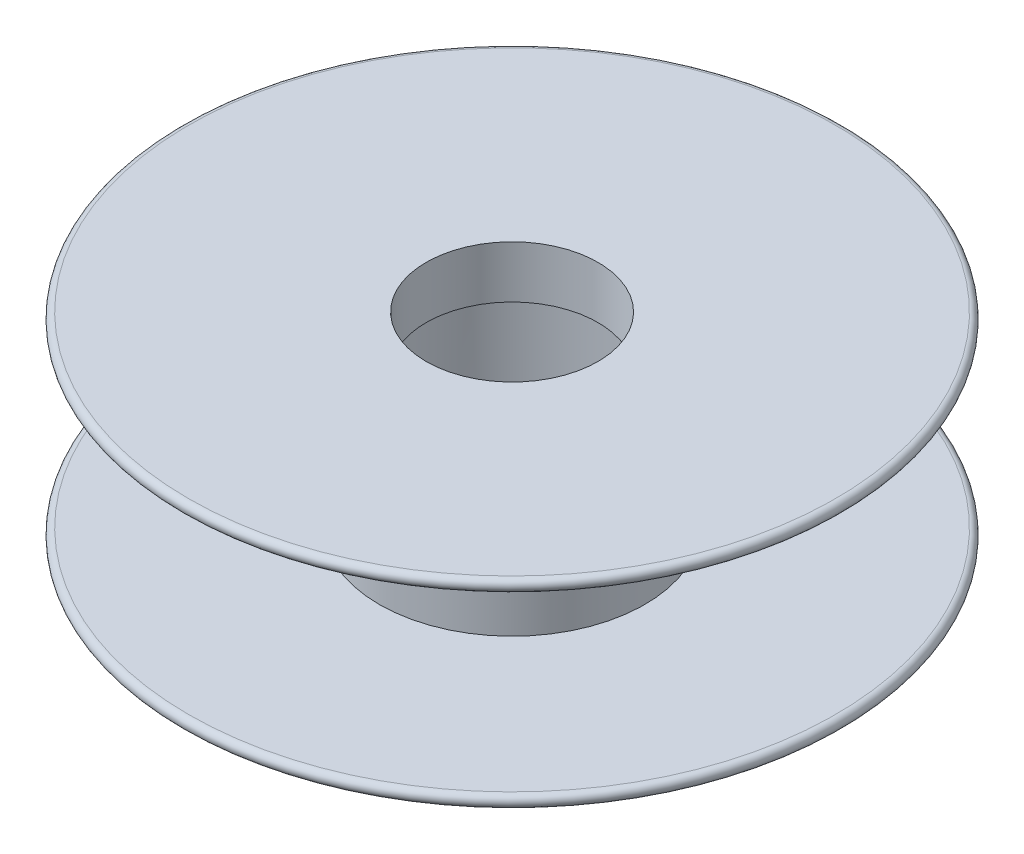
ISO-10303-21;
HEADER;
FILE_DESCRIPTION(('STEP AP214'),'2;1');
FILE_NAME('part.step','',(''),(''),'','','');
FILE_SCHEMA(('AUTOMOTIVE_DESIGN { 1 0 10303 214 1 1 1 1 }'));
ENDSEC;
DATA;
#1=APPLICATION_CONTEXT('core data for automotive mechanical design processes');
#2=APPLICATION_PROTOCOL_DEFINITION('international standard','automotive_design',2000,#1);
#3=PRODUCT_CONTEXT('',#1,'mechanical');
#4=PRODUCT('Part','Part','',(#3));
#5=PRODUCT_RELATED_PRODUCT_CATEGORY('part','',(#4));
#6=PRODUCT_DEFINITION_FORMATION('','',#4);
#7=PRODUCT_DEFINITION_CONTEXT('part definition',#1,'design');
#8=PRODUCT_DEFINITION('design','',#6,#7);
#9=PRODUCT_DEFINITION_SHAPE('','',#8);
#10=(LENGTH_UNIT() NAMED_UNIT(*) SI_UNIT(.MILLI.,.METRE.));
#11=(NAMED_UNIT(*) PLANE_ANGLE_UNIT() SI_UNIT($,.RADIAN.));
#12=(NAMED_UNIT(*) SI_UNIT($,.STERADIAN.) SOLID_ANGLE_UNIT());
#13=UNCERTAINTY_MEASURE_WITH_UNIT(LENGTH_MEASURE(1.E-05),#10,'distance_accuracy_value','');
#14=(GEOMETRIC_REPRESENTATION_CONTEXT(3) GLOBAL_UNCERTAINTY_ASSIGNED_CONTEXT((#13)) GLOBAL_UNIT_ASSIGNED_CONTEXT((#10,
#11,#12)) REPRESENTATION_CONTEXT('',''));
#15=CARTESIAN_POINT('',(0.,0.,0.));
#16=DIRECTION('',(0.,0.,1.));
#17=DIRECTION('',(1.,0.,0.));
#18=AXIS2_PLACEMENT_3D('',#15,#16,#17);
#19=CARTESIAN_POINT('',(0.,3.7,0.));
#20=DIRECTION('',(0.,1.,0.));
#21=DIRECTION('',(0.,0.,1.));
#22=AXIS2_PLACEMENT_3D('',#19,#20,#21);
#23=PLANE('',#22);
#24=CARTESIAN_POINT('',(0.,3.7,0.));
#25=DIRECTION('',(0.,1.,0.));
#26=DIRECTION('',(0.,0.,1.));
#27=AXIS2_PLACEMENT_3D('',#24,#25,#26);
#28=CIRCLE('',#27,97.4);
#29=CARTESIAN_POINT('',(0.,3.7,97.4));
#30=VERTEX_POINT('',#29);
#31=EDGE_CURVE('E52',#30,#30,#28,.T.);
#32=ORIENTED_EDGE('',*,*,#31,.T.);
#33=EDGE_LOOP('',(#32));
#34=FACE_BOUND('',#33,.T.);
#35=CARTESIAN_POINT('',(0.,3.7,0.));
#36=DIRECTION('',(0.,1.,0.));
#37=DIRECTION('',(0.,0.,1.));
#38=AXIS2_PLACEMENT_3D('',#35,#36,#37);
#39=CIRCLE('',#38,40.);
#40=CARTESIAN_POINT('',(0.,3.7,40.));
#41=VERTEX_POINT('',#40);
#42=EDGE_CURVE('E61',#41,#41,#39,.T.);
#43=ORIENTED_EDGE('',*,*,#42,.F.);
#44=EDGE_LOOP('',(#43));
#45=FACE_BOUND('',#44,.T.);
#46=ADVANCED_FACE('F37',(#34,#45),#23,.T.);
#47=CARTESIAN_POINT('',(0.,1.85,0.));
#48=DIRECTION('',(0.,1.,0.));
#49=DIRECTION('',(0.,0.,1.));
#50=AXIS2_PLACEMENT_3D('',#47,#48,#49);
#51=TOROIDAL_SURFACE('',#50,97.4,1.85);
#52=ORIENTED_EDGE('',*,*,#31,.F.);
#53=EDGE_LOOP('',(#52));
#54=FACE_BOUND('',#53,.T.);
#55=CARTESIAN_POINT('',(0.,0.,0.));
#56=DIRECTION('',(0.,1.,0.));
#57=DIRECTION('',(0.,0.,1.));
#58=AXIS2_PLACEMENT_3D('',#55,#56,#57);
#59=CIRCLE('',#58,97.4);
#60=CARTESIAN_POINT('',(0.,0.,97.4));
#61=VERTEX_POINT('',#60);
#62=EDGE_CURVE('E45',#61,#61,#59,.F.);
#63=ORIENTED_EDGE('',*,*,#62,.F.);
#64=EDGE_LOOP('',(#63));
#65=FACE_BOUND('',#64,.T.);
#66=ADVANCED_FACE('F39',(#54,#65),#51,.T.);
#67=CARTESIAN_POINT('',(0.,0.,0.));
#68=DIRECTION('',(0.,1.,0.));
#69=DIRECTION('',(0.,0.,1.));
#70=AXIS2_PLACEMENT_3D('',#67,#68,#69);
#71=PLANE('',#70);
#72=ORIENTED_EDGE('',*,*,#62,.T.);
#73=EDGE_LOOP('',(#72));
#74=FACE_BOUND('',#73,.T.);
#75=CARTESIAN_POINT('',(0.,0.,0.));
#76=DIRECTION('',(0.,1.,0.));
#77=DIRECTION('',(0.,0.,1.));
#78=AXIS2_PLACEMENT_3D('',#75,#76,#77);
#79=CIRCLE('',#78,25.875);
#80=CARTESIAN_POINT('',(0.,0.,25.875));
#81=VERTEX_POINT('',#80);
#82=EDGE_CURVE('E56',#81,#81,#79,.T.);
#83=ORIENTED_EDGE('',*,*,#82,.T.);
#84=EDGE_LOOP('',(#83));
#85=FACE_BOUND('',#84,.T.);
#86=ADVANCED_FACE('F113',(#74,#85),#71,.F.);
#87=CARTESIAN_POINT('',(0.,3.7,0.));
#88=DIRECTION('',(0.,-1.,0.));
#89=DIRECTION('',(0.,0.,-1.));
#90=AXIS2_PLACEMENT_3D('',#87,#88,#89);
#91=CYLINDRICAL_SURFACE('',#90,25.875);
#92=ORIENTED_EDGE('',*,*,#82,.F.);
#93=EDGE_LOOP('',(#92));
#94=FACE_BOUND('',#93,.T.);
#95=CARTESIAN_POINT('',(0.,15.7,0.));
#96=DIRECTION('',(0.,1.,0.));
#97=DIRECTION('',(0.,0.,1.));
#98=AXIS2_PLACEMENT_3D('',#95,#96,#97);
#99=CIRCLE('',#98,25.875);
#100=CARTESIAN_POINT('',(0.,15.7,25.875));
#101=VERTEX_POINT('',#100);
#102=EDGE_CURVE('E64',#101,#101,#99,.T.);
#103=ORIENTED_EDGE('',*,*,#102,.T.);
#104=EDGE_LOOP('',(#103));
#105=FACE_BOUND('',#104,.T.);
#106=ADVANCED_FACE('F117',(#94,#105),#91,.F.);
#107=CARTESIAN_POINT('',(0.,15.7,0.));
#108=DIRECTION('',(0.,1.,0.));
#109=DIRECTION('',(0.,0.,1.));
#110=AXIS2_PLACEMENT_3D('',#107,#108,#109);
#111=PLANE('',#110);
#112=CARTESIAN_POINT('',(0.,15.7,0.));
#113=DIRECTION('',(0.,1.,0.));
#114=DIRECTION('',(0.,0.,1.));
#115=AXIS2_PLACEMENT_3D('',#112,#113,#114);
#116=CIRCLE('',#115,35.);
#117=CARTESIAN_POINT('',(0.,15.7,35.));
#118=VERTEX_POINT('',#117);
#119=EDGE_CURVE('E10',#118,#118,#116,.F.);
#120=ORIENTED_EDGE('',*,*,#119,.F.);
#121=EDGE_LOOP('',(#120));
#122=FACE_BOUND('',#121,.T.);
#123=ORIENTED_EDGE('',*,*,#102,.F.);
#124=EDGE_LOOP('',(#123));
#125=FACE_BOUND('',#124,.T.);
#126=ADVANCED_FACE('F123',(#122,#125),#111,.T.);
#127=CARTESIAN_POINT('',(0.,15.7,0.));
#128=DIRECTION('',(0.,-1.,0.));
#129=DIRECTION('',(0.,0.,-1.));
#130=AXIS2_PLACEMENT_3D('',#127,#128,#129);
#131=CYLINDRICAL_SURFACE('',#130,40.);
#132=ORIENTED_EDGE('',*,*,#42,.T.);
#133=EDGE_LOOP('',(#132));
#134=FACE_BOUND('',#133,.T.);
#135=CARTESIAN_POINT('',(0.,56.3,0.));
#136=DIRECTION('',(0.,1.,0.));
#137=DIRECTION('',(0.,0.,1.));
#138=AXIS2_PLACEMENT_3D('',#135,#136,#137);
#139=CIRCLE('',#138,40.);
#140=CARTESIAN_POINT('',(0.,56.3,40.));
#141=VERTEX_POINT('',#140);
#142=EDGE_CURVE('E82',#141,#141,#139,.T.);
#143=ORIENTED_EDGE('',*,*,#142,.F.);
#144=EDGE_LOOP('',(#143));
#145=FACE_BOUND('',#144,.T.);
#146=ADVANCED_FACE('F131',(#134,#145),#131,.T.);
#147=CARTESIAN_POINT('',(0.,-97.4370849898476,0.));
#148=DIRECTION('',(0.,1.,0.));
#149=DIRECTION('',(0.,0.,1.));
#150=AXIS2_PLACEMENT_3D('',#147,#148,#149);
#151=CYLINDRICAL_SURFACE('',#150,35.);
#152=ORIENTED_EDGE('',*,*,#119,.T.);
#153=EDGE_LOOP('',(#152));
#154=FACE_BOUND('',#153,.T.);
#155=CARTESIAN_POINT('',(0.,44.3,0.));
#156=DIRECTION('',(0.,-1.,0.));
#157=DIRECTION('',(0.,0.,-1.));
#158=AXIS2_PLACEMENT_3D('',#155,#156,#157);
#159=CIRCLE('',#158,35.);
#160=CARTESIAN_POINT('',(0.,44.3,-35.));
#161=VERTEX_POINT('',#160);
#162=EDGE_CURVE('E67',#161,#161,#159,.T.);
#163=ORIENTED_EDGE('',*,*,#162,.F.);
#164=EDGE_LOOP('',(#163));
#165=FACE_BOUND('',#164,.T.);
#166=ADVANCED_FACE('F137',(#154,#165),#151,.F.);
#167=CARTESIAN_POINT('',(0.,56.3,0.));
#168=DIRECTION('',(0.,-1.,0.));
#169=DIRECTION('',(0.,0.,1.));
#170=AXIS2_PLACEMENT_3D('',#167,#168,#169);
#171=PLANE('',#170);
#172=CARTESIAN_POINT('',(0.,56.3,0.));
#173=DIRECTION('',(0.,1.,0.));
#174=DIRECTION('',(0.,0.,1.));
#175=AXIS2_PLACEMENT_3D('',#172,#173,#174);
#176=CIRCLE('',#175,97.4);
#177=CARTESIAN_POINT('',(0.,56.3,97.4));
#178=VERTEX_POINT('',#177);
#179=EDGE_CURVE('E75',#178,#178,#176,.T.);
#180=ORIENTED_EDGE('',*,*,#179,.F.);
#181=EDGE_LOOP('',(#180));
#182=FACE_BOUND('',#181,.T.);
#183=ORIENTED_EDGE('',*,*,#142,.T.);
#184=EDGE_LOOP('',(#183));
#185=FACE_BOUND('',#184,.T.);
#186=ADVANCED_FACE('F142',(#182,#185),#171,.T.);
#187=CARTESIAN_POINT('',(0.,58.15,0.));
#188=DIRECTION('',(0.,-1.,0.));
#189=DIRECTION('',(0.,0.,1.));
#190=AXIS2_PLACEMENT_3D('',#187,#188,#189);
#191=TOROIDAL_SURFACE('',#190,97.4,1.85);
#192=ORIENTED_EDGE('',*,*,#179,.T.);
#193=EDGE_LOOP('',(#192));
#194=FACE_BOUND('',#193,.T.);
#195=CARTESIAN_POINT('',(0.,60.,0.));
#196=DIRECTION('',(0.,1.,0.));
#197=DIRECTION('',(0.,0.,1.));
#198=AXIS2_PLACEMENT_3D('',#195,#196,#197);
#199=CIRCLE('',#198,97.4);
#200=CARTESIAN_POINT('',(0.,60.,97.4));
#201=VERTEX_POINT('',#200);
#202=EDGE_CURVE('E71',#201,#201,#199,.F.);
#203=ORIENTED_EDGE('',*,*,#202,.T.);
#204=EDGE_LOOP('',(#203));
#205=FACE_BOUND('',#204,.T.);
#206=ADVANCED_FACE('F103',(#194,#205),#191,.T.);
#207=CARTESIAN_POINT('',(0.,60.,0.));
#208=DIRECTION('',(0.,-1.,0.));
#209=DIRECTION('',(0.,0.,1.));
#210=AXIS2_PLACEMENT_3D('',#207,#208,#209);
#211=PLANE('',#210);
#212=ORIENTED_EDGE('',*,*,#202,.F.);
#213=EDGE_LOOP('',(#212));
#214=FACE_BOUND('',#213,.T.);
#215=CARTESIAN_POINT('',(0.,60.,0.));
#216=DIRECTION('',(0.,1.,0.));
#217=DIRECTION('',(0.,0.,1.));
#218=AXIS2_PLACEMENT_3D('',#215,#216,#217);
#219=CIRCLE('',#218,25.875);
#220=CARTESIAN_POINT('',(0.,60.,25.875));
#221=VERTEX_POINT('',#220);
#222=EDGE_CURVE('E79',#221,#221,#219,.T.);
#223=ORIENTED_EDGE('',*,*,#222,.F.);
#224=EDGE_LOOP('',(#223));
#225=FACE_BOUND('',#224,.T.);
#226=ADVANCED_FACE('F94',(#214,#225),#211,.F.);
#227=CARTESIAN_POINT('',(0.,56.3,0.));
#228=DIRECTION('',(0.,1.,0.));
#229=DIRECTION('',(0.,0.,-1.));
#230=AXIS2_PLACEMENT_3D('',#227,#228,#229);
#231=CYLINDRICAL_SURFACE('',#230,25.875);
#232=ORIENTED_EDGE('',*,*,#222,.T.);
#233=EDGE_LOOP('',(#232));
#234=FACE_BOUND('',#233,.T.);
#235=CARTESIAN_POINT('',(0.,44.3,0.));
#236=DIRECTION('',(0.,1.,0.));
#237=DIRECTION('',(0.,0.,1.));
#238=AXIS2_PLACEMENT_3D('',#235,#236,#237);
#239=CIRCLE('',#238,25.875);
#240=CARTESIAN_POINT('',(0.,44.3,25.875));
#241=VERTEX_POINT('',#240);
#242=EDGE_CURVE('E85',#241,#241,#239,.T.);
#243=ORIENTED_EDGE('',*,*,#242,.F.);
#244=EDGE_LOOP('',(#243));
#245=FACE_BOUND('',#244,.T.);
#246=ADVANCED_FACE('F92',(#234,#245),#231,.F.);
#247=CARTESIAN_POINT('',(0.,44.3,0.));
#248=DIRECTION('',(0.,-1.,0.));
#249=DIRECTION('',(0.,0.,1.));
#250=AXIS2_PLACEMENT_3D('',#247,#248,#249);
#251=PLANE('',#250);
#252=ORIENTED_EDGE('',*,*,#162,.T.);
#253=EDGE_LOOP('',(#252));
#254=FACE_BOUND('',#253,.T.);
#255=ORIENTED_EDGE('',*,*,#242,.T.);
#256=EDGE_LOOP('',(#255));
#257=FACE_BOUND('',#256,.T.);
#258=ADVANCED_FACE('F90',(#254,#257),#251,.T.);
#259=CLOSED_SHELL('',(#46,#66,#86,#106,#126,#146,#166,#186,#206,#226,#246,#258));
#260=MANIFOLD_SOLID_BREP('B2',#259);
#261=ADVANCED_BREP_SHAPE_REPRESENTATION('',(#18,#260),#14);
#262=SHAPE_DEFINITION_REPRESENTATION(#9,#261);
ENDSEC;
END-ISO-10303-21;
